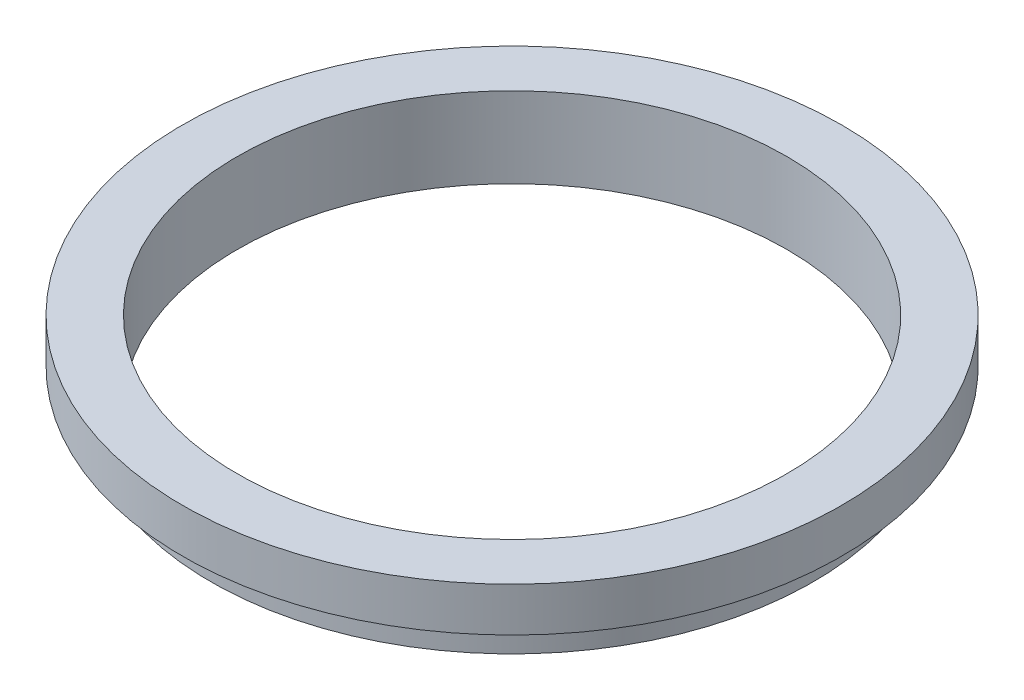
ISO-10303-21;
HEADER;
FILE_DESCRIPTION(('STEP AP214'),'2;1');
FILE_NAME('part.step','',(''),(''),'','','');
FILE_SCHEMA(('AUTOMOTIVE_DESIGN { 1 0 10303 214 1 1 1 1 }'));
ENDSEC;
DATA;
#1=APPLICATION_CONTEXT('core data for automotive mechanical design processes');
#2=APPLICATION_PROTOCOL_DEFINITION('international standard','automotive_design',2000,#1);
#3=PRODUCT_CONTEXT('',#1,'mechanical');
#4=PRODUCT('Part','Part','',(#3));
#5=PRODUCT_RELATED_PRODUCT_CATEGORY('part','',(#4));
#6=PRODUCT_DEFINITION_FORMATION('','',#4);
#7=PRODUCT_DEFINITION_CONTEXT('part definition',#1,'design');
#8=PRODUCT_DEFINITION('design','',#6,#7);
#9=PRODUCT_DEFINITION_SHAPE('','',#8);
#10=(LENGTH_UNIT() NAMED_UNIT(*) SI_UNIT(.MILLI.,.METRE.));
#11=(NAMED_UNIT(*) PLANE_ANGLE_UNIT() SI_UNIT($,.RADIAN.));
#12=(NAMED_UNIT(*) SI_UNIT($,.STERADIAN.) SOLID_ANGLE_UNIT());
#13=UNCERTAINTY_MEASURE_WITH_UNIT(LENGTH_MEASURE(1.E-05),#10,'distance_accuracy_value','');
#14=(GEOMETRIC_REPRESENTATION_CONTEXT(3) GLOBAL_UNCERTAINTY_ASSIGNED_CONTEXT((#13)) GLOBAL_UNIT_ASSIGNED_CONTEXT((#10,
#11,#12)) REPRESENTATION_CONTEXT('',''));
#15=CARTESIAN_POINT('',(0.,0.,0.));
#16=DIRECTION('',(0.,0.,1.));
#17=DIRECTION('',(1.,0.,0.));
#18=AXIS2_PLACEMENT_3D('',#15,#16,#17);
#19=CARTESIAN_POINT('',(0.,0.,0.));
#20=DIRECTION('',(0.,-1.,0.));
#21=DIRECTION('',(0.,0.,-1.));
#22=AXIS2_PLACEMENT_3D('',#19,#20,#21);
#23=CYLINDRICAL_SURFACE('',#22,142.494);
#24=CARTESIAN_POINT('',(0.,12.7,0.));
#25=DIRECTION('',(0.,-1.,0.));
#26=DIRECTION('',(0.,0.,-1.));
#27=AXIS2_PLACEMENT_3D('',#24,#25,#26);
#28=CIRCLE('',#27,142.494);
#29=CARTESIAN_POINT('',(0.,12.7,-142.494));
#30=VERTEX_POINT('',#29);
#31=EDGE_CURVE('E10',#30,#30,#28,.T.);
#32=ORIENTED_EDGE('',*,*,#31,.T.);
#33=EDGE_LOOP('',(#32));
#34=FACE_BOUND('',#33,.T.);
#35=CARTESIAN_POINT('',(0.,0.,0.));
#36=DIRECTION('',(0.,-1.,0.));
#37=DIRECTION('',(0.,0.,-1.));
#38=AXIS2_PLACEMENT_3D('',#35,#36,#37);
#39=CIRCLE('',#38,142.494);
#40=CARTESIAN_POINT('',(0.,0.,-142.494));
#41=VERTEX_POINT('',#40);
#42=EDGE_CURVE('E72',#41,#41,#39,.T.);
#43=ORIENTED_EDGE('',*,*,#42,.F.);
#44=EDGE_LOOP('',(#43));
#45=FACE_BOUND('',#44,.T.);
#46=ADVANCED_FACE('F37',(#34,#45),#23,.T.);
#47=CARTESIAN_POINT('',(143.396454904956,12.7,0.));
#48=DIRECTION('',(0.,-1.,0.));
#49=DIRECTION('',(0.,0.,-1.));
#50=AXIS2_PLACEMENT_3D('',#47,#48,#49);
#51=PLANE('',#50);
#52=CARTESIAN_POINT('',(0.,12.7,0.));
#53=DIRECTION('',(0.,-1.,0.));
#54=DIRECTION('',(0.,0.,-1.));
#55=AXIS2_PLACEMENT_3D('',#52,#53,#54);
#56=CIRCLE('',#55,143.396454904956);
#57=CARTESIAN_POINT('',(0.,12.7,-143.396454904956));
#58=VERTEX_POINT('',#57);
#59=EDGE_CURVE('E44',#58,#58,#56,.T.);
#60=ORIENTED_EDGE('',*,*,#59,.T.);
#61=EDGE_LOOP('',(#60));
#62=FACE_BOUND('',#61,.T.);
#63=ORIENTED_EDGE('',*,*,#31,.F.);
#64=EDGE_LOOP('',(#63));
#65=FACE_BOUND('',#64,.T.);
#66=ADVANCED_FACE('F81',(#62,#65),#51,.T.);
#67=CARTESIAN_POINT('',(0.,10.6561622492499,0.));
#68=DIRECTION('',(0.,-1.,0.));
#69=DIRECTION('',(0.,0.,-1.));
#70=AXIS2_PLACEMENT_3D('',#67,#68,#69);
#71=TOROIDAL_SURFACE('',#70,149.676227452478,6.60399999999999);
#72=CARTESIAN_POINT('',(0.,17.2601622492499,0.));
#73=DIRECTION('',(0.,-1.,0.));
#74=DIRECTION('',(0.,0.,-1.));
#75=AXIS2_PLACEMENT_3D('',#72,#73,#74);
#76=CIRCLE('',#75,149.676227452478);
#77=CARTESIAN_POINT('',(0.,17.2601622492499,-149.676227452478));
#78=VERTEX_POINT('',#77);
#79=EDGE_CURVE('E49',#78,#78,#76,.T.);
#80=ORIENTED_EDGE('',*,*,#79,.T.);
#81=EDGE_LOOP('',(#80));
#82=FACE_BOUND('',#81,.T.);
#83=ORIENTED_EDGE('',*,*,#59,.F.);
#84=EDGE_LOOP('',(#83));
#85=FACE_BOUND('',#84,.T.);
#86=ADVANCED_FACE('F85',(#82,#85),#71,.F.);
#87=CARTESIAN_POINT('',(149.676227452478,17.2601622492499,0.));
#88=DIRECTION('',(0.,-1.,0.));
#89=DIRECTION('',(0.,0.,-1.));
#90=AXIS2_PLACEMENT_3D('',#87,#88,#89);
#91=PLANE('',#90);
#92=CARTESIAN_POINT('',(0.,17.2601622492499,0.));
#93=DIRECTION('',(0.,-1.,0.));
#94=DIRECTION('',(0.,0.,-1.));
#95=AXIS2_PLACEMENT_3D('',#92,#93,#94);
#96=CIRCLE('',#95,155.956);
#97=CARTESIAN_POINT('',(0.,17.2601622492499,-155.956));
#98=VERTEX_POINT('',#97);
#99=EDGE_CURVE('E54',#98,#98,#96,.T.);
#100=ORIENTED_EDGE('',*,*,#99,.T.);
#101=EDGE_LOOP('',(#100));
#102=FACE_BOUND('',#101,.T.);
#103=ORIENTED_EDGE('',*,*,#79,.F.);
#104=EDGE_LOOP('',(#103));
#105=FACE_BOUND('',#104,.T.);
#106=ADVANCED_FACE('F89',(#102,#105),#91,.T.);
#107=CARTESIAN_POINT('',(0.,0.,0.));
#108=DIRECTION('',(0.,-1.,0.));
#109=DIRECTION('',(0.,0.,-1.));
#110=AXIS2_PLACEMENT_3D('',#107,#108,#109);
#111=CYLINDRICAL_SURFACE('',#110,155.956);
#112=CARTESIAN_POINT('',(0.,38.1,0.));
#113=DIRECTION('',(0.,-1.,0.));
#114=DIRECTION('',(0.,0.,-1.));
#115=AXIS2_PLACEMENT_3D('',#112,#113,#114);
#116=CIRCLE('',#115,155.956);
#117=CARTESIAN_POINT('',(0.,38.1,-155.956));
#118=VERTEX_POINT('',#117);
#119=EDGE_CURVE('E60',#118,#118,#116,.T.);
#120=ORIENTED_EDGE('',*,*,#119,.T.);
#121=EDGE_LOOP('',(#120));
#122=FACE_BOUND('',#121,.T.);
#123=ORIENTED_EDGE('',*,*,#99,.F.);
#124=EDGE_LOOP('',(#123));
#125=FACE_BOUND('',#124,.T.);
#126=ADVANCED_FACE('F96',(#122,#125),#111,.T.);
#127=CARTESIAN_POINT('',(130.048,38.1,0.));
#128=DIRECTION('',(0.,1.,0.));
#129=DIRECTION('',(0.,0.,1.));
#130=AXIS2_PLACEMENT_3D('',#127,#128,#129);
#131=PLANE('',#130);
#132=CARTESIAN_POINT('',(0.,38.1,0.));
#133=DIRECTION('',(0.,-1.,0.));
#134=DIRECTION('',(0.,0.,-1.));
#135=AXIS2_PLACEMENT_3D('',#132,#133,#134);
#136=CIRCLE('',#135,130.048);
#137=CARTESIAN_POINT('',(0.,38.1,-130.048));
#138=VERTEX_POINT('',#137);
#139=EDGE_CURVE('E64',#138,#138,#136,.T.);
#140=ORIENTED_EDGE('',*,*,#139,.T.);
#141=EDGE_LOOP('',(#140));
#142=FACE_BOUND('',#141,.T.);
#143=ORIENTED_EDGE('',*,*,#119,.F.);
#144=EDGE_LOOP('',(#143));
#145=FACE_BOUND('',#144,.T.);
#146=ADVANCED_FACE('F100',(#142,#145),#131,.T.);
#147=CARTESIAN_POINT('',(0.,0.,0.));
#148=DIRECTION('',(0.,-1.,0.));
#149=DIRECTION('',(0.,0.,-1.));
#150=AXIS2_PLACEMENT_3D('',#147,#148,#149);
#151=CYLINDRICAL_SURFACE('',#150,130.048);
#152=CARTESIAN_POINT('',(0.,0.,0.));
#153=DIRECTION('',(0.,-1.,0.));
#154=DIRECTION('',(0.,0.,-1.));
#155=AXIS2_PLACEMENT_3D('',#152,#153,#154);
#156=CIRCLE('',#155,130.048);
#157=CARTESIAN_POINT('',(0.,0.,-130.048));
#158=VERTEX_POINT('',#157);
#159=EDGE_CURVE('E68',#158,#158,#156,.T.);
#160=ORIENTED_EDGE('',*,*,#159,.T.);
#161=EDGE_LOOP('',(#160));
#162=FACE_BOUND('',#161,.T.);
#163=ORIENTED_EDGE('',*,*,#139,.F.);
#164=EDGE_LOOP('',(#163));
#165=FACE_BOUND('',#164,.T.);
#166=ADVANCED_FACE('F104',(#162,#165),#151,.F.);
#167=CARTESIAN_POINT('',(142.494,0.,0.));
#168=DIRECTION('',(0.,-1.,0.));
#169=DIRECTION('',(0.,0.,-1.));
#170=AXIS2_PLACEMENT_3D('',#167,#168,#169);
#171=PLANE('',#170);
#172=ORIENTED_EDGE('',*,*,#42,.T.);
#173=EDGE_LOOP('',(#172));
#174=FACE_BOUND('',#173,.T.);
#175=ORIENTED_EDGE('',*,*,#159,.F.);
#176=EDGE_LOOP('',(#175));
#177=FACE_BOUND('',#176,.T.);
#178=ADVANCED_FACE('F77',(#174,#177),#171,.T.);
#179=CLOSED_SHELL('',(#46,#66,#86,#106,#126,#146,#166,#178));
#180=MANIFOLD_SOLID_BREP('B2',#179);
#181=ADVANCED_BREP_SHAPE_REPRESENTATION('',(#18,#180),#14);
#182=SHAPE_DEFINITION_REPRESENTATION(#9,#181);
ENDSEC;
END-ISO-10303-21;
